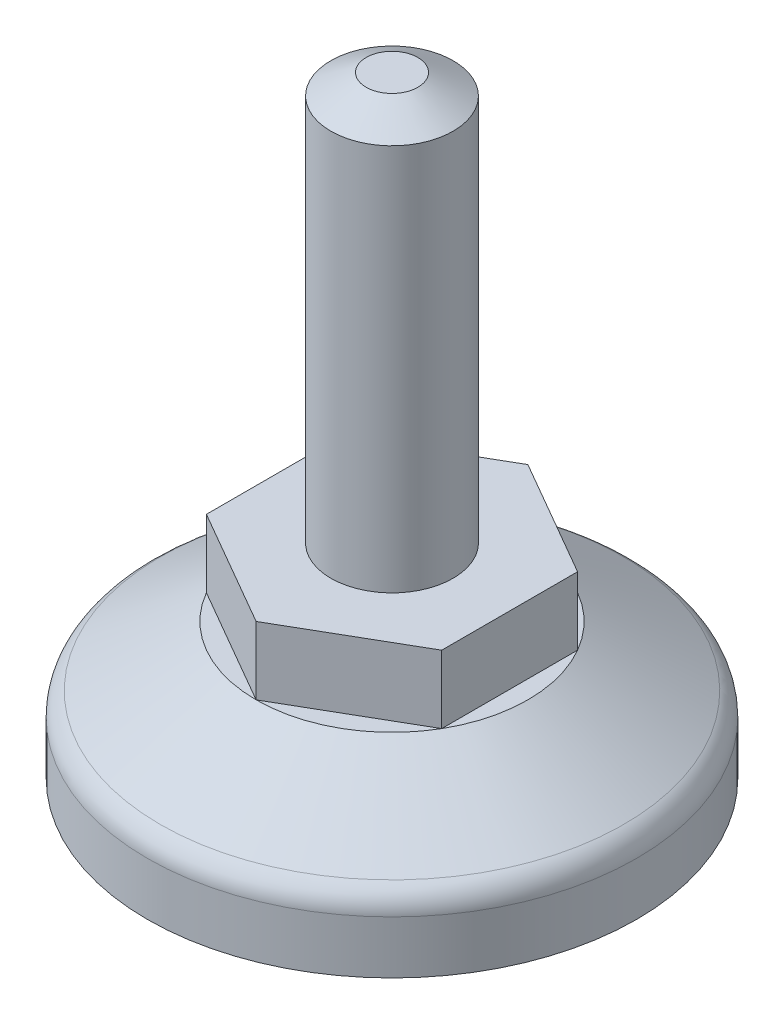
ISO-10303-21;
HEADER;
FILE_DESCRIPTION(('STEP AP214'),'2;1');
FILE_NAME('part.step','',(''),(''),'','','');
FILE_SCHEMA(('AUTOMOTIVE_DESIGN { 1 0 10303 214 1 1 1 1 }'));
ENDSEC;
DATA;
#1=APPLICATION_CONTEXT('core data for automotive mechanical design processes');
#2=APPLICATION_PROTOCOL_DEFINITION('international standard','automotive_design',2000,#1);
#3=PRODUCT_CONTEXT('',#1,'mechanical');
#4=PRODUCT('Part','Part','',(#3));
#5=PRODUCT_RELATED_PRODUCT_CATEGORY('part','',(#4));
#6=PRODUCT_DEFINITION_FORMATION('','',#4);
#7=PRODUCT_DEFINITION_CONTEXT('part definition',#1,'design');
#8=PRODUCT_DEFINITION('design','',#6,#7);
#9=PRODUCT_DEFINITION_SHAPE('','',#8);
#10=(LENGTH_UNIT() NAMED_UNIT(*) SI_UNIT(.MILLI.,.METRE.));
#11=(NAMED_UNIT(*) PLANE_ANGLE_UNIT() SI_UNIT($,.RADIAN.));
#12=(NAMED_UNIT(*) SI_UNIT($,.STERADIAN.) SOLID_ANGLE_UNIT());
#13=UNCERTAINTY_MEASURE_WITH_UNIT(LENGTH_MEASURE(1.E-05),#10,'distance_accuracy_value','');
#14=(GEOMETRIC_REPRESENTATION_CONTEXT(3) GLOBAL_UNCERTAINTY_ASSIGNED_CONTEXT((#13)) GLOBAL_UNIT_ASSIGNED_CONTEXT((#10,
#11,#12)) REPRESENTATION_CONTEXT('',''));
#15=CARTESIAN_POINT('',(0.,0.,0.));
#16=DIRECTION('',(0.,0.,1.));
#17=DIRECTION('',(1.,0.,0.));
#18=AXIS2_PLACEMENT_3D('',#15,#16,#17);
#19=CARTESIAN_POINT('',(8.66025403784443,15.,15.));
#20=DIRECTION('',(0.,1.,0.));
#21=DIRECTION('',(0.,0.,1.));
#22=AXIS2_PLACEMENT_3D('',#19,#20,#21);
#23=PLANE('',#22);
#24=DIRECTION('',(0.866025403784442,0.,0.499999999999995));
#25=VECTOR('',#24,1.);
#26=CARTESIAN_POINT('',(-8.66025403784433,15.,5.0000000000001));
#27=LINE('',#26,#25);
#28=CARTESIAN_POINT('',(-8.66025403784433,15.,5.0000000000001));
#29=VERTEX_POINT('',#28);
#30=CARTESIAN_POINT('',(0.,15.,10.));
#31=VERTEX_POINT('',#30);
#32=EDGE_CURVE('E224',#29,#31,#27,.T.);
#33=ORIENTED_EDGE('',*,*,#32,.T.);
#34=DIRECTION('',(0.866025403784438,0.,-0.500000000000001));
#35=VECTOR('',#34,1.);
#36=CARTESIAN_POINT('',(0.,15.,10.));
#37=LINE('',#36,#35);
#38=CARTESIAN_POINT('',(8.6602540378444,15.,4.99999999999998));
#39=VERTEX_POINT('',#38);
#40=EDGE_CURVE('E226',#31,#39,#37,.T.);
#41=ORIENTED_EDGE('',*,*,#40,.T.);
#42=DIRECTION('',(0.,0.,-1.));
#43=VECTOR('',#42,1.);
#44=CARTESIAN_POINT('',(8.6602540378444,15.,4.99999999999998));
#45=LINE('',#44,#43);
#46=CARTESIAN_POINT('',(8.66025403784436,15.,-5.00000000000004));
#47=VERTEX_POINT('',#46);
#48=EDGE_CURVE('E120',#39,#47,#45,.T.);
#49=ORIENTED_EDGE('',*,*,#48,.T.);
#50=DIRECTION('',(-0.866025403784441,0.,-0.499999999999995));
#51=VECTOR('',#50,1.);
#52=CARTESIAN_POINT('',(8.66025403784436,15.,-5.00000000000004));
#53=LINE('',#52,#51);
#54=CARTESIAN_POINT('',(0.,15.,-10.));
#55=VERTEX_POINT('',#54);
#56=EDGE_CURVE('E229',#47,#55,#53,.T.);
#57=ORIENTED_EDGE('',*,*,#56,.T.);
#58=DIRECTION('',(-0.866025403784435,0.,0.500000000000007));
#59=VECTOR('',#58,1.);
#60=CARTESIAN_POINT('',(0.,15.,-10.));
#61=LINE('',#60,#59);
#62=CARTESIAN_POINT('',(-8.66025403784443,15.,-4.99999999999992));
#63=VERTEX_POINT('',#62);
#64=EDGE_CURVE('E231',#55,#63,#61,.T.);
#65=ORIENTED_EDGE('',*,*,#64,.T.);
#66=DIRECTION('',(0.,0.,1.));
#67=VECTOR('',#66,1.);
#68=CARTESIAN_POINT('',(-8.66025403784443,15.,-4.99999999999992));
#69=LINE('',#68,#67);
#70=EDGE_CURVE('E233',#63,#29,#69,.T.);
#71=ORIENTED_EDGE('',*,*,#70,.T.);
#72=EDGE_LOOP('',(#33,#41,#49,#57,#65,#71));
#73=FACE_BOUND('',#72,.T.);
#74=CARTESIAN_POINT('',(0.,15.,0.));
#75=DIRECTION('',(0.,1.,0.));
#76=DIRECTION('',(0.,0.,1.));
#77=AXIS2_PLACEMENT_3D('',#74,#75,#76);
#78=CIRCLE('',#77,4.5);
#79=CARTESIAN_POINT('',(0.,15.,4.5));
#80=VERTEX_POINT('',#79);
#81=EDGE_CURVE('E246',#80,#80,#78,.T.);
#82=ORIENTED_EDGE('',*,*,#81,.F.);
#83=EDGE_LOOP('',(#82));
#84=FACE_BOUND('',#83,.T.);
#85=ADVANCED_FACE('F30',(#73,#84),#23,.T.);
#86=CARTESIAN_POINT('',(10.,10.,0.));
#87=DIRECTION('',(0.,1.,0.));
#88=DIRECTION('',(0.,0.,1.));
#89=AXIS2_PLACEMENT_3D('',#86,#87,#88);
#90=PLANE('',#89);
#91=DIRECTION('',(0.866025403784442,0.,0.499999999999995));
#92=VECTOR('',#91,1.);
#93=CARTESIAN_POINT('',(-8.66025403784433,10.,5.0000000000001));
#94=LINE('',#93,#92);
#95=CARTESIAN_POINT('',(-8.66025403784433,10.,5.0000000000001));
#96=VERTEX_POINT('',#95);
#97=CARTESIAN_POINT('',(0.,10.,10.));
#98=VERTEX_POINT('',#97);
#99=EDGE_CURVE('E51',#96,#98,#94,.T.);
#100=ORIENTED_EDGE('',*,*,#99,.F.);
#101=CARTESIAN_POINT('',(0.,10.,0.));
#102=DIRECTION('',(0.,-1.,0.));
#103=DIRECTION('',(0.,0.,-1.));
#104=AXIS2_PLACEMENT_3D('',#101,#102,#103);
#105=CIRCLE('',#104,10.);
#106=EDGE_CURVE('E102',#98,#96,#105,.T.);
#107=ORIENTED_EDGE('',*,*,#106,.F.);
#108=EDGE_LOOP('',(#100,#107));
#109=FACE_BOUND('',#108,.T.);
#110=ADVANCED_FACE('F154',(#109),#90,.T.);
#111=DIRECTION('',(0.,0.,1.));
#112=VECTOR('',#111,1.);
#113=CARTESIAN_POINT('',(-8.66025403784443,10.,-4.99999999999992));
#114=LINE('',#113,#112);
#115=CARTESIAN_POINT('',(-8.66025403784443,10.,-4.99999999999992));
#116=VERTEX_POINT('',#115);
#117=EDGE_CURVE('E44',#116,#96,#114,.T.);
#118=ORIENTED_EDGE('',*,*,#117,.F.);
#119=EDGE_CURVE('E365',#96,#116,#105,.T.);
#120=ORIENTED_EDGE('',*,*,#119,.F.);
#121=EDGE_LOOP('',(#118,#120));
#122=FACE_BOUND('',#121,.T.);
#123=ADVANCED_FACE('F160',(#122),#90,.T.);
#124=DIRECTION('',(-0.866025403784435,0.,0.500000000000007));
#125=VECTOR('',#124,1.);
#126=CARTESIAN_POINT('',(0.,10.,-10.));
#127=LINE('',#126,#125);
#128=CARTESIAN_POINT('',(0.,10.,-10.));
#129=VERTEX_POINT('',#128);
#130=EDGE_CURVE('E218',#129,#116,#127,.T.);
#131=ORIENTED_EDGE('',*,*,#130,.F.);
#132=EDGE_CURVE('E123',#116,#129,#105,.T.);
#133=ORIENTED_EDGE('',*,*,#132,.F.);
#134=EDGE_LOOP('',(#131,#133));
#135=FACE_BOUND('',#134,.T.);
#136=ADVANCED_FACE('F209',(#135),#90,.T.);
#137=DIRECTION('',(-0.866025403784441,0.,-0.499999999999995));
#138=VECTOR('',#137,1.);
#139=CARTESIAN_POINT('',(8.66025403784436,10.,-5.00000000000004));
#140=LINE('',#139,#138);
#141=CARTESIAN_POINT('',(8.66025403784436,10.,-5.00000000000004));
#142=VERTEX_POINT('',#141);
#143=EDGE_CURVE('E109',#142,#129,#140,.T.);
#144=ORIENTED_EDGE('',*,*,#143,.F.);
#145=EDGE_CURVE('E93',#129,#142,#105,.T.);
#146=ORIENTED_EDGE('',*,*,#145,.F.);
#147=EDGE_LOOP('',(#144,#146));
#148=FACE_BOUND('',#147,.T.);
#149=ADVANCED_FACE('F205',(#148),#90,.T.);
#150=DIRECTION('',(0.,0.,-1.));
#151=VECTOR('',#150,1.);
#152=CARTESIAN_POINT('',(8.6602540378444,10.,4.99999999999998));
#153=LINE('',#152,#151);
#154=CARTESIAN_POINT('',(8.6602540378444,10.,4.99999999999998));
#155=VERTEX_POINT('',#154);
#156=EDGE_CURVE('E103',#155,#142,#153,.T.);
#157=ORIENTED_EDGE('',*,*,#156,.F.);
#158=EDGE_CURVE('E85',#142,#155,#105,.T.);
#159=ORIENTED_EDGE('',*,*,#158,.F.);
#160=EDGE_LOOP('',(#157,#159));
#161=FACE_BOUND('',#160,.T.);
#162=ADVANCED_FACE('F104',(#161),#90,.T.);
#163=CARTESIAN_POINT('',(0.,0.,0.));
#164=DIRECTION('',(0.,-1.,0.));
#165=DIRECTION('',(0.,0.,-1.));
#166=AXIS2_PLACEMENT_3D('',#163,#164,#165);
#167=PLANE('',#166);
#168=CARTESIAN_POINT('',(0.,0.,0.));
#169=DIRECTION('',(0.,-1.,0.));
#170=DIRECTION('',(0.,0.,-1.));
#171=AXIS2_PLACEMENT_3D('',#168,#169,#170);
#172=CIRCLE('',#171,18.);
#173=CARTESIAN_POINT('',(0.,0.,-18.));
#174=VERTEX_POINT('',#173);
#175=EDGE_CURVE('E129',#174,#174,#172,.T.);
#176=ORIENTED_EDGE('',*,*,#175,.T.);
#177=EDGE_LOOP('',(#176));
#178=FACE_BOUND('',#177,.T.);
#179=ADVANCED_FACE('F32',(#178),#167,.T.);
#180=CARTESIAN_POINT('',(0.,0.,0.));
#181=DIRECTION('',(0.,-1.,0.));
#182=DIRECTION('',(0.,0.,-1.));
#183=AXIS2_PLACEMENT_3D('',#180,#181,#182);
#184=CYLINDRICAL_SURFACE('',#183,18.);
#185=CARTESIAN_POINT('',(0.,3.89150471698585,0.));
#186=DIRECTION('',(0.,1.,0.));
#187=DIRECTION('',(0.,0.,1.));
#188=AXIS2_PLACEMENT_3D('',#185,#186,#187);
#189=CIRCLE('',#188,18.);
#190=CARTESIAN_POINT('',(0.,3.89150471698585,18.));
#191=VERTEX_POINT('',#190);
#192=EDGE_CURVE('E132',#191,#191,#189,.F.);
#193=ORIENTED_EDGE('',*,*,#192,.T.);
#194=EDGE_LOOP('',(#193));
#195=FACE_BOUND('',#194,.T.);
#196=ORIENTED_EDGE('',*,*,#175,.F.);
#197=EDGE_LOOP('',(#196));
#198=FACE_BOUND('',#197,.T.);
#199=ADVANCED_FACE('F190',(#195,#198),#184,.T.);
#200=CARTESIAN_POINT('',(0.,5.,0.));
#201=DIRECTION('',(0.,-1.,0.));
#202=DIRECTION('',(0.,0.,-1.));
#203=AXIS2_PLACEMENT_3D('',#200,#201,#202);
#204=CONICAL_SURFACE('',#203,18.,1.01219701145133);
#205=CARTESIAN_POINT('',(0.,5.58750132499603,0.));
#206=DIRECTION('',(0.,1.,0.));
#207=DIRECTION('',(0.,0.,1.));
#208=AXIS2_PLACEMENT_3D('',#205,#206,#207);
#209=CIRCLE('',#208,17.0599978800064);
#210=CARTESIAN_POINT('',(0.,5.58750132499603,17.0599978800064));
#211=VERTEX_POINT('',#210);
#212=EDGE_CURVE('E135',#211,#211,#209,.T.);
#213=ORIENTED_EDGE('',*,*,#212,.T.);
#214=EDGE_LOOP('',(#213));
#215=FACE_BOUND('',#214,.T.);
#216=ORIENTED_EDGE('',*,*,#145,.T.);
#217=ORIENTED_EDGE('',*,*,#158,.T.);
#218=EDGE_CURVE('E89',#155,#98,#105,.T.);
#219=ORIENTED_EDGE('',*,*,#218,.T.);
#220=ORIENTED_EDGE('',*,*,#106,.T.);
#221=ORIENTED_EDGE('',*,*,#119,.T.);
#222=ORIENTED_EDGE('',*,*,#132,.T.);
#223=EDGE_LOOP('',(#216,#217,#219,#220,#221,#222));
#224=FACE_BOUND('',#223,.T.);
#225=ADVANCED_FACE('F87',(#215,#224),#204,.T.);
#226=DIRECTION('',(0.866025403784438,0.,-0.500000000000001));
#227=VECTOR('',#226,1.);
#228=CARTESIAN_POINT('',(0.,10.,10.));
#229=LINE('',#228,#227);
#230=EDGE_CURVE('E101',#98,#155,#229,.T.);
#231=ORIENTED_EDGE('',*,*,#230,.F.);
#232=ORIENTED_EDGE('',*,*,#218,.F.);
#233=EDGE_LOOP('',(#231,#232));
#234=FACE_BOUND('',#233,.T.);
#235=ADVANCED_FACE('F99',(#234),#90,.T.);
#236=CARTESIAN_POINT('',(-8.66025403784433,15.,5.0000000000001));
#237=DIRECTION('',(0.499999999999995,0.,-0.866025403784442));
#238=DIRECTION('',(-0.866025403784442,0.,-0.499999999999995));
#239=AXIS2_PLACEMENT_3D('',#236,#237,#238);
#240=PLANE('',#239);
#241=ORIENTED_EDGE('',*,*,#99,.T.);
#242=DIRECTION('',(0.,-1.,0.));
#243=VECTOR('',#242,1.);
#244=CARTESIAN_POINT('',(0.,15.,10.));
#245=LINE('',#244,#243);
#246=EDGE_CURVE('E117',#31,#98,#245,.T.);
#247=ORIENTED_EDGE('',*,*,#246,.F.);
#248=ORIENTED_EDGE('',*,*,#32,.F.);
#249=DIRECTION('',(0.,-1.,0.));
#250=VECTOR('',#249,1.);
#251=CARTESIAN_POINT('',(-8.66025403784433,15.,5.0000000000001));
#252=LINE('',#251,#250);
#253=EDGE_CURVE('E235',#29,#96,#252,.T.);
#254=ORIENTED_EDGE('',*,*,#253,.T.);
#255=EDGE_LOOP('',(#241,#247,#248,#254));
#256=FACE_BOUND('',#255,.T.);
#257=ADVANCED_FACE('F184',(#256),#240,.F.);
#258=CARTESIAN_POINT('',(0.,15.,10.));
#259=DIRECTION('',(-0.500000000000001,0.,-0.866025403784438));
#260=DIRECTION('',(-0.866025403784438,0.,0.500000000000001));
#261=AXIS2_PLACEMENT_3D('',#258,#259,#260);
#262=PLANE('',#261);
#263=ORIENTED_EDGE('',*,*,#230,.T.);
#264=DIRECTION('',(0.,-1.,0.));
#265=VECTOR('',#264,1.);
#266=CARTESIAN_POINT('',(8.6602540378444,15.,4.99999999999998));
#267=LINE('',#266,#265);
#268=EDGE_CURVE('E114',#39,#155,#267,.T.);
#269=ORIENTED_EDGE('',*,*,#268,.F.);
#270=ORIENTED_EDGE('',*,*,#40,.F.);
#271=ORIENTED_EDGE('',*,*,#246,.T.);
#272=EDGE_LOOP('',(#263,#269,#270,#271));
#273=FACE_BOUND('',#272,.T.);
#274=ADVANCED_FACE('F113',(#273),#262,.F.);
#275=CARTESIAN_POINT('',(8.6602540378444,15.,4.99999999999998));
#276=DIRECTION('',(-1.,0.,0.));
#277=DIRECTION('',(0.,0.,1.));
#278=AXIS2_PLACEMENT_3D('',#275,#276,#277);
#279=PLANE('',#278);
#280=ORIENTED_EDGE('',*,*,#156,.T.);
#281=DIRECTION('',(0.,-1.,0.));
#282=VECTOR('',#281,1.);
#283=CARTESIAN_POINT('',(8.66025403784436,15.,-5.00000000000004));
#284=LINE('',#283,#282);
#285=EDGE_CURVE('E121',#47,#142,#284,.T.);
#286=ORIENTED_EDGE('',*,*,#285,.F.);
#287=ORIENTED_EDGE('',*,*,#48,.F.);
#288=ORIENTED_EDGE('',*,*,#268,.T.);
#289=EDGE_LOOP('',(#280,#286,#287,#288));
#290=FACE_BOUND('',#289,.T.);
#291=ADVANCED_FACE('F119',(#290),#279,.F.);
#292=CARTESIAN_POINT('',(8.66025403784436,15.,-5.00000000000004));
#293=DIRECTION('',(-0.499999999999995,0.,0.866025403784442));
#294=DIRECTION('',(0.866025403784442,0.,0.499999999999995));
#295=AXIS2_PLACEMENT_3D('',#292,#293,#294);
#296=PLANE('',#295);
#297=ORIENTED_EDGE('',*,*,#143,.T.);
#298=DIRECTION('',(0.,-1.,0.));
#299=VECTOR('',#298,1.);
#300=CARTESIAN_POINT('',(0.,15.,-10.));
#301=LINE('',#300,#299);
#302=EDGE_CURVE('E125',#55,#129,#301,.T.);
#303=ORIENTED_EDGE('',*,*,#302,.F.);
#304=ORIENTED_EDGE('',*,*,#56,.F.);
#305=ORIENTED_EDGE('',*,*,#285,.T.);
#306=EDGE_LOOP('',(#297,#303,#304,#305));
#307=FACE_BOUND('',#306,.T.);
#308=ADVANCED_FACE('F175',(#307),#296,.F.);
#309=CARTESIAN_POINT('',(0.,15.,-10.));
#310=DIRECTION('',(0.500000000000007,0.,0.866025403784435));
#311=DIRECTION('',(0.866025403784435,0.,-0.500000000000007));
#312=AXIS2_PLACEMENT_3D('',#309,#310,#311);
#313=PLANE('',#312);
#314=ORIENTED_EDGE('',*,*,#130,.T.);
#315=DIRECTION('',(0.,-1.,0.));
#316=VECTOR('',#315,1.);
#317=CARTESIAN_POINT('',(-8.66025403784443,15.,-4.99999999999992));
#318=LINE('',#317,#316);
#319=EDGE_CURVE('E238',#63,#116,#318,.T.);
#320=ORIENTED_EDGE('',*,*,#319,.F.);
#321=ORIENTED_EDGE('',*,*,#64,.F.);
#322=ORIENTED_EDGE('',*,*,#302,.T.);
#323=EDGE_LOOP('',(#314,#320,#321,#322));
#324=FACE_BOUND('',#323,.T.);
#325=ADVANCED_FACE('F171',(#324),#313,.F.);
#326=CARTESIAN_POINT('',(-8.66025403784443,15.,-4.99999999999992));
#327=DIRECTION('',(1.,0.,0.));
#328=DIRECTION('',(0.,0.,-1.));
#329=AXIS2_PLACEMENT_3D('',#326,#327,#328);
#330=PLANE('',#329);
#331=ORIENTED_EDGE('',*,*,#117,.T.);
#332=ORIENTED_EDGE('',*,*,#253,.F.);
#333=ORIENTED_EDGE('',*,*,#70,.F.);
#334=ORIENTED_EDGE('',*,*,#319,.T.);
#335=EDGE_LOOP('',(#331,#332,#333,#334));
#336=FACE_BOUND('',#335,.T.);
#337=ADVANCED_FACE('F168',(#336),#330,.F.);
#338=CARTESIAN_POINT('',(0.,45.,0.));
#339=DIRECTION('',(0.,-1.,0.));
#340=DIRECTION('',(0.,0.,-1.));
#341=AXIS2_PLACEMENT_3D('',#338,#339,#340);
#342=CYLINDRICAL_SURFACE('',#341,4.5);
#343=CARTESIAN_POINT('',(0.,43.5,0.));
#344=DIRECTION('',(0.,1.,0.));
#345=DIRECTION('',(0.,0.,1.));
#346=AXIS2_PLACEMENT_3D('',#343,#344,#345);
#347=CIRCLE('',#346,4.5);
#348=CARTESIAN_POINT('',(0.,43.5,4.5));
#349=VERTEX_POINT('',#348);
#350=EDGE_CURVE('E11',#349,#349,#347,.F.);
#351=ORIENTED_EDGE('',*,*,#350,.T.);
#352=EDGE_LOOP('',(#351));
#353=FACE_BOUND('',#352,.T.);
#354=ORIENTED_EDGE('',*,*,#81,.T.);
#355=EDGE_LOOP('',(#354));
#356=FACE_BOUND('',#355,.T.);
#357=ADVANCED_FACE('F166',(#353,#356),#342,.T.);
#358=CARTESIAN_POINT('',(0.,45.,0.));
#359=DIRECTION('',(0.,1.,0.));
#360=DIRECTION('',(0.,0.,1.));
#361=AXIS2_PLACEMENT_3D('',#358,#359,#360);
#362=PLANE('',#361);
#363=CARTESIAN_POINT('',(0.,45.,0.));
#364=DIRECTION('',(0.,1.,0.));
#365=DIRECTION('',(0.,0.,1.));
#366=AXIS2_PLACEMENT_3D('',#363,#364,#365);
#367=CIRCLE('',#366,1.90192378864663);
#368=CARTESIAN_POINT('',(0.,45.,1.90192378864663));
#369=VERTEX_POINT('',#368);
#370=EDGE_CURVE('E38',#369,#369,#367,.T.);
#371=ORIENTED_EDGE('',*,*,#370,.T.);
#372=EDGE_LOOP('',(#371));
#373=FACE_BOUND('',#372,.T.);
#374=ADVANCED_FACE('F140',(#373),#362,.T.);
#375=CARTESIAN_POINT('',(0.,3.89150471698585,0.));
#376=DIRECTION('',(0.,1.,0.));
#377=DIRECTION('',(0.,0.,1.));
#378=AXIS2_PLACEMENT_3D('',#375,#376,#377);
#379=TOROIDAL_SURFACE('',#378,16.,2.);
#380=ORIENTED_EDGE('',*,*,#212,.F.);
#381=EDGE_LOOP('',(#380));
#382=FACE_BOUND('',#381,.T.);
#383=ORIENTED_EDGE('',*,*,#192,.F.);
#384=EDGE_LOOP('',(#383));
#385=FACE_BOUND('',#384,.T.);
#386=ADVANCED_FACE('F144',(#382,#385),#379,.T.);
#387=CARTESIAN_POINT('',(0.,45.,0.));
#388=DIRECTION('',(0.,-1.,0.));
#389=DIRECTION('',(0.,0.,-1.));
#390=AXIS2_PLACEMENT_3D('',#387,#388,#389);
#391=CONICAL_SURFACE('',#390,1.90192378864663,1.0471975511966);
#392=ORIENTED_EDGE('',*,*,#350,.F.);
#393=EDGE_LOOP('',(#392));
#394=FACE_BOUND('',#393,.T.);
#395=ORIENTED_EDGE('',*,*,#370,.F.);
#396=EDGE_LOOP('',(#395));
#397=FACE_BOUND('',#396,.T.);
#398=ADVANCED_FACE('F142',(#394,#397),#391,.T.);
#399=CLOSED_SHELL('',(#85,#110,#123,#136,#149,#162,#179,#199,#225,#235,#257,#274,#291,#308,#325,
#337,#357,#374,#386,#398));
#400=MANIFOLD_SOLID_BREP('B2',#399);
#401=ADVANCED_BREP_SHAPE_REPRESENTATION('',(#18,#400),#14);
#402=SHAPE_DEFINITION_REPRESENTATION(#9,#401);
ENDSEC;
END-ISO-10303-21;
